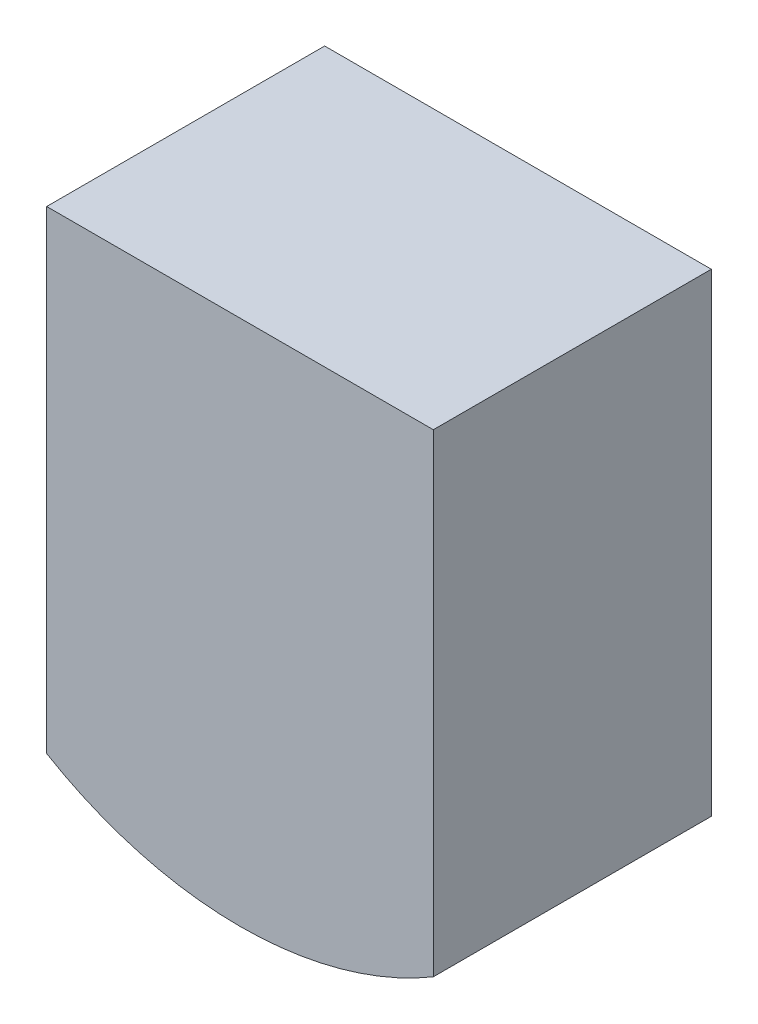
ISO-10303-21;
HEADER;
FILE_DESCRIPTION(('STEP AP214'),'2;1');
FILE_NAME('part.step','',(''),(''),'','','');
FILE_SCHEMA(('AUTOMOTIVE_DESIGN { 1 0 10303 214 1 1 1 1 }'));
ENDSEC;
DATA;
#1=APPLICATION_CONTEXT('core data for automotive mechanical design processes');
#2=APPLICATION_PROTOCOL_DEFINITION('international standard','automotive_design',2000,#1);
#3=PRODUCT_CONTEXT('',#1,'mechanical');
#4=PRODUCT('Part','Part','',(#3));
#5=PRODUCT_RELATED_PRODUCT_CATEGORY('part','',(#4));
#6=PRODUCT_DEFINITION_FORMATION('','',#4);
#7=PRODUCT_DEFINITION_CONTEXT('part definition',#1,'design');
#8=PRODUCT_DEFINITION('design','',#6,#7);
#9=PRODUCT_DEFINITION_SHAPE('','',#8);
#10=(LENGTH_UNIT() NAMED_UNIT(*) SI_UNIT(.MILLI.,.METRE.));
#11=(NAMED_UNIT(*) PLANE_ANGLE_UNIT() SI_UNIT($,.RADIAN.));
#12=(NAMED_UNIT(*) SI_UNIT($,.STERADIAN.) SOLID_ANGLE_UNIT());
#13=UNCERTAINTY_MEASURE_WITH_UNIT(LENGTH_MEASURE(1.E-05),#10,'distance_accuracy_value','');
#14=(GEOMETRIC_REPRESENTATION_CONTEXT(3) GLOBAL_UNCERTAINTY_ASSIGNED_CONTEXT((#13)) GLOBAL_UNIT_ASSIGNED_CONTEXT((#10,
#11,#12)) REPRESENTATION_CONTEXT('',''));
#15=CARTESIAN_POINT('',(0.,0.,0.));
#16=DIRECTION('',(0.,0.,1.));
#17=DIRECTION('',(1.,0.,0.));
#18=AXIS2_PLACEMENT_3D('',#15,#16,#17);
#19=CARTESIAN_POINT('',(-5.36999999999992,-8.33473839861832,3.3));
#20=DIRECTION('',(0.,0.,1.));
#21=DIRECTION('',(0.,-1.,0.));
#22=AXIS2_PLACEMENT_3D('',#19,#20,#21);
#23=PLANE('',#22);
#24=DIRECTION('',(0.,-1.,0.));
#25=VECTOR('',#24,1.);
#26=CARTESIAN_POINT('',(-6.9,-10.,3.3));
#27=LINE('',#26,#25);
#28=CARTESIAN_POINT('',(-6.89999999999991,-6.25,3.3));
#29=VERTEX_POINT('',#28);
#30=CARTESIAN_POINT('',(-6.9,-10.,3.3));
#31=VERTEX_POINT('',#30);
#32=EDGE_CURVE('E11',#29,#31,#27,.T.);
#33=ORIENTED_EDGE('',*,*,#32,.T.);
#34=CARTESIAN_POINT('',(-5.36999999999993,-7.41947679723665,3.3));
#35=DIRECTION('',(0.,0.,1.));
#36=DIRECTION('',(-0.51,-0.860174400921116,0.));
#37=AXIS2_PLACEMENT_3D('',#34,#35,#36);
#38=CIRCLE('',#37,3.);
#39=CARTESIAN_POINT('',(-3.83999999999993,-10.,3.3));
#40=VERTEX_POINT('',#39);
#41=EDGE_CURVE('E83',#31,#40,#38,.T.);
#42=ORIENTED_EDGE('',*,*,#41,.T.);
#43=DIRECTION('',(0.,1.,0.));
#44=VECTOR('',#43,1.);
#45=CARTESIAN_POINT('',(-3.83999999999992,-6.25,3.3));
#46=LINE('',#45,#44);
#47=CARTESIAN_POINT('',(-3.83999999999992,-6.25,3.3));
#48=VERTEX_POINT('',#47);
#49=EDGE_CURVE('E106',#40,#48,#46,.T.);
#50=ORIENTED_EDGE('',*,*,#49,.T.);
#51=DIRECTION('',(-1.,0.,0.));
#52=VECTOR('',#51,1.);
#53=CARTESIAN_POINT('',(-6.89999999999991,-6.25,3.3));
#54=LINE('',#53,#52);
#55=EDGE_CURVE('E232',#48,#29,#54,.T.);
#56=ORIENTED_EDGE('',*,*,#55,.T.);
#57=EDGE_LOOP('',(#33,#42,#50,#56));
#58=FACE_BOUND('',#57,.T.);
#59=ADVANCED_FACE('F16',(#58),#23,.T.);
#60=CARTESIAN_POINT('',(-6.89999999999991,-6.25,2.2));
#61=DIRECTION('',(-1.,0.,0.));
#62=DIRECTION('',(0.,0.,1.));
#63=AXIS2_PLACEMENT_3D('',#60,#61,#62);
#64=PLANE('',#63);
#65=DIRECTION('',(0.,0.,1.));
#66=VECTOR('',#65,1.);
#67=CARTESIAN_POINT('',(-6.9,-10.,2.2));
#68=LINE('',#67,#66);
#69=CARTESIAN_POINT('',(-6.9,-10.,1.1));
#70=VERTEX_POINT('',#69);
#71=EDGE_CURVE('E26',#70,#31,#68,.T.);
#72=ORIENTED_EDGE('',*,*,#71,.T.);
#73=ORIENTED_EDGE('',*,*,#32,.F.);
#74=DIRECTION('',(0.,0.,-1.));
#75=VECTOR('',#74,1.);
#76=CARTESIAN_POINT('',(-6.89999999999991,-6.25,2.2));
#77=LINE('',#76,#75);
#78=CARTESIAN_POINT('',(-6.89999999999991,-6.25,1.1));
#79=VERTEX_POINT('',#78);
#80=EDGE_CURVE('E94',#29,#79,#77,.T.);
#81=ORIENTED_EDGE('',*,*,#80,.T.);
#82=DIRECTION('',(0.,1.,0.));
#83=VECTOR('',#82,1.);
#84=CARTESIAN_POINT('',(-6.9,-10.,1.1));
#85=LINE('',#84,#83);
#86=EDGE_CURVE('E91',#70,#79,#85,.T.);
#87=ORIENTED_EDGE('',*,*,#86,.F.);
#88=EDGE_LOOP('',(#72,#73,#81,#87));
#89=FACE_BOUND('',#88,.T.);
#90=ADVANCED_FACE('F18',(#89),#64,.T.);
#91=CARTESIAN_POINT('',(-5.36999999999993,-7.41947679723665,2.2));
#92=DIRECTION('',(0.,0.,1.));
#93=DIRECTION('',(-0.51,-0.860174400921116,0.));
#94=AXIS2_PLACEMENT_3D('',#91,#92,#93);
#95=CYLINDRICAL_SURFACE('',#94,3.);
#96=DIRECTION('',(0.,0.,1.));
#97=VECTOR('',#96,1.);
#98=CARTESIAN_POINT('',(-3.83999999999993,-10.,2.2));
#99=LINE('',#98,#97);
#100=CARTESIAN_POINT('',(-3.83999999999993,-10.,1.1));
#101=VERTEX_POINT('',#100);
#102=EDGE_CURVE('E62',#101,#40,#99,.T.);
#103=ORIENTED_EDGE('',*,*,#102,.T.);
#104=ORIENTED_EDGE('',*,*,#41,.F.);
#105=ORIENTED_EDGE('',*,*,#71,.F.);
#106=CARTESIAN_POINT('',(-5.36999999999993,-7.41947679723665,1.1));
#107=DIRECTION('',(0.,0.,-1.));
#108=DIRECTION('',(-0.51,-0.860174400921116,0.));
#109=AXIS2_PLACEMENT_3D('',#106,#107,#108);
#110=CIRCLE('',#109,3.);
#111=EDGE_CURVE('E81',#101,#70,#110,.T.);
#112=ORIENTED_EDGE('',*,*,#111,.F.);
#113=EDGE_LOOP('',(#103,#104,#105,#112));
#114=FACE_BOUND('',#113,.T.);
#115=ADVANCED_FACE('F80',(#114),#95,.T.);
#116=CARTESIAN_POINT('',(-3.83999999999993,-10.,2.2));
#117=DIRECTION('',(1.,0.,0.));
#118=DIRECTION('',(0.,-1.,0.));
#119=AXIS2_PLACEMENT_3D('',#116,#117,#118);
#120=PLANE('',#119);
#121=DIRECTION('',(0.,0.,1.));
#122=VECTOR('',#121,1.);
#123=CARTESIAN_POINT('',(-3.83999999999992,-6.25,2.2));
#124=LINE('',#123,#122);
#125=CARTESIAN_POINT('',(-3.83999999999992,-6.25,1.1));
#126=VERTEX_POINT('',#125);
#127=EDGE_CURVE('E72',#126,#48,#124,.T.);
#128=ORIENTED_EDGE('',*,*,#127,.T.);
#129=ORIENTED_EDGE('',*,*,#49,.F.);
#130=ORIENTED_EDGE('',*,*,#102,.F.);
#131=DIRECTION('',(0.,-1.,0.));
#132=VECTOR('',#131,1.);
#133=CARTESIAN_POINT('',(-3.83999999999992,-6.25,1.1));
#134=LINE('',#133,#132);
#135=EDGE_CURVE('E92',#126,#101,#134,.T.);
#136=ORIENTED_EDGE('',*,*,#135,.F.);
#137=EDGE_LOOP('',(#128,#129,#130,#136));
#138=FACE_BOUND('',#137,.T.);
#139=ADVANCED_FACE('F134',(#138),#120,.T.);
#140=CARTESIAN_POINT('',(-3.83999999999992,-6.25,2.2));
#141=DIRECTION('',(0.,1.,0.));
#142=DIRECTION('',(1.,0.,0.));
#143=AXIS2_PLACEMENT_3D('',#140,#141,#142);
#144=PLANE('',#143);
#145=ORIENTED_EDGE('',*,*,#80,.F.);
#146=ORIENTED_EDGE('',*,*,#55,.F.);
#147=ORIENTED_EDGE('',*,*,#127,.F.);
#148=DIRECTION('',(1.,0.,0.));
#149=VECTOR('',#148,1.);
#150=CARTESIAN_POINT('',(-6.89999999999991,-6.25,1.1));
#151=LINE('',#150,#149);
#152=EDGE_CURVE('E98',#79,#126,#151,.T.);
#153=ORIENTED_EDGE('',*,*,#152,.F.);
#154=EDGE_LOOP('',(#145,#146,#147,#153));
#155=FACE_BOUND('',#154,.T.);
#156=ADVANCED_FACE('F128',(#155),#144,.T.);
#157=CARTESIAN_POINT('',(-5.36999999999992,-8.33473839861832,1.1));
#158=DIRECTION('',(0.,0.,1.));
#159=DIRECTION('',(0.,-1.,0.));
#160=AXIS2_PLACEMENT_3D('',#157,#158,#159);
#161=PLANE('',#160);
#162=ORIENTED_EDGE('',*,*,#86,.T.);
#163=ORIENTED_EDGE('',*,*,#152,.T.);
#164=ORIENTED_EDGE('',*,*,#135,.T.);
#165=ORIENTED_EDGE('',*,*,#111,.T.);
#166=EDGE_LOOP('',(#162,#163,#164,#165));
#167=FACE_BOUND('',#166,.T.);
#168=ADVANCED_FACE('F89',(#167),#161,.F.);
#169=CLOSED_SHELL('',(#59,#90,#115,#139,#156,#168));
#170=MANIFOLD_SOLID_BREP('B1',#169);
#171=ADVANCED_BREP_SHAPE_REPRESENTATION('',(#18,#170),#14);
#172=SHAPE_DEFINITION_REPRESENTATION(#9,#171);
ENDSEC;
END-ISO-10303-21;
